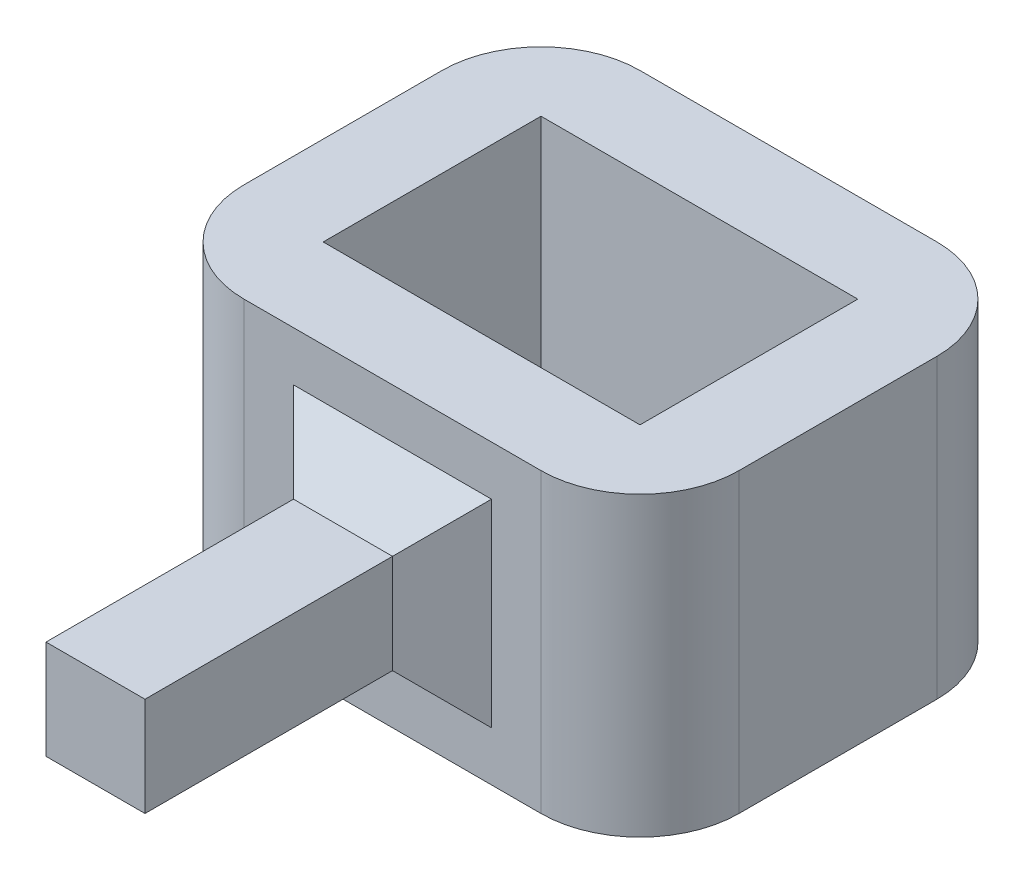
ISO-10303-21;
HEADER;
FILE_DESCRIPTION(('STEP AP214'),'2;1');
FILE_NAME('part.step','',(''),(''),'','','');
FILE_SCHEMA(('AUTOMOTIVE_DESIGN { 1 0 10303 214 1 1 1 1 }'));
ENDSEC;
DATA;
#1=APPLICATION_CONTEXT('core data for automotive mechanical design processes');
#2=APPLICATION_PROTOCOL_DEFINITION('international standard','automotive_design',2000,#1);
#3=PRODUCT_CONTEXT('',#1,'mechanical');
#4=PRODUCT('Part','Part','',(#3));
#5=PRODUCT_RELATED_PRODUCT_CATEGORY('part','',(#4));
#6=PRODUCT_DEFINITION_FORMATION('','',#4);
#7=PRODUCT_DEFINITION_CONTEXT('part definition',#1,'design');
#8=PRODUCT_DEFINITION('design','',#6,#7);
#9=PRODUCT_DEFINITION_SHAPE('','',#8);
#10=(LENGTH_UNIT() NAMED_UNIT(*) SI_UNIT(.MILLI.,.METRE.));
#11=(NAMED_UNIT(*) PLANE_ANGLE_UNIT() SI_UNIT($,.RADIAN.));
#12=(NAMED_UNIT(*) SI_UNIT($,.STERADIAN.) SOLID_ANGLE_UNIT());
#13=UNCERTAINTY_MEASURE_WITH_UNIT(LENGTH_MEASURE(1.E-05),#10,'distance_accuracy_value','');
#14=(GEOMETRIC_REPRESENTATION_CONTEXT(3) GLOBAL_UNCERTAINTY_ASSIGNED_CONTEXT((#13)) GLOBAL_UNIT_ASSIGNED_CONTEXT((#10,
#11,#12)) REPRESENTATION_CONTEXT('',''));
#15=CARTESIAN_POINT('',(0.,0.,0.));
#16=DIRECTION('',(0.,0.,1.));
#17=DIRECTION('',(1.,0.,0.));
#18=AXIS2_PLACEMENT_3D('',#15,#16,#17);
#19=CARTESIAN_POINT('',(26.8704783995024,30.,27.8608923884514));
#20=DIRECTION('',(0.,0.,-1.));
#21=DIRECTION('',(-1.,0.,0.));
#22=AXIS2_PLACEMENT_3D('',#19,#20,#21);
#23=PLANE('',#22);
#24=DIRECTION('',(0.,1.,0.));
#25=VECTOR('',#24,1.);
#26=CARTESIAN_POINT('',(-8.12952160049759,30.,27.8608923884514));
#27=LINE('',#26,#25);
#28=CARTESIAN_POINT('',(-8.12952160049758,5.00000000000002,27.8608923884514));
#29=VERTEX_POINT('',#28);
#30=CARTESIAN_POINT('',(-8.12952160049758,25.,27.8608923884514));
#31=VERTEX_POINT('',#30);
#32=EDGE_CURVE('E253',#29,#31,#27,.T.);
#33=ORIENTED_EDGE('',*,*,#32,.T.);
#34=DIRECTION('',(1.,0.,0.));
#35=VECTOR('',#34,1.);
#36=CARTESIAN_POINT('',(26.8704783995024,25.,27.8608923884514));
#37=LINE('',#36,#35);
#38=CARTESIAN_POINT('',(11.8704783995024,25.,27.8608923884514));
#39=VERTEX_POINT('',#38);
#40=EDGE_CURVE('E255',#31,#39,#37,.T.);
#41=ORIENTED_EDGE('',*,*,#40,.T.);
#42=DIRECTION('',(0.,-1.,0.));
#43=VECTOR('',#42,1.);
#44=CARTESIAN_POINT('',(11.8704783995024,10.,27.8608923884514));
#45=LINE('',#44,#43);
#46=CARTESIAN_POINT('',(11.8704783995024,5.00000000000002,27.8608923884514));
#47=VERTEX_POINT('',#46);
#48=EDGE_CURVE('E240',#39,#47,#45,.T.);
#49=ORIENTED_EDGE('',*,*,#48,.T.);
#50=DIRECTION('',(-1.,0.,0.));
#51=VECTOR('',#50,1.);
#52=CARTESIAN_POINT('',(-3.12952160049761,5.00000000000002,27.8608923884514));
#53=LINE('',#52,#51);
#54=EDGE_CURVE('E251',#47,#29,#53,.T.);
#55=ORIENTED_EDGE('',*,*,#54,.T.);
#56=EDGE_LOOP('',(#33,#41,#49,#55));
#57=FACE_BOUND('',#56,.T.);
#58=DIRECTION('',(1.,0.,0.));
#59=VECTOR('',#58,1.);
#60=CARTESIAN_POINT('',(26.8704783995024,0.,27.8608923884514));
#61=LINE('',#60,#59);
#62=CARTESIAN_POINT('',(-13.1295216004976,0.,27.8608923884514));
#63=VERTEX_POINT('',#62);
#64=CARTESIAN_POINT('',(16.8704783995024,0.,27.8608923884514));
#65=VERTEX_POINT('',#64);
#66=EDGE_CURVE('E233',#63,#65,#61,.T.);
#67=ORIENTED_EDGE('',*,*,#66,.T.);
#68=DIRECTION('',(0.,-1.,0.));
#69=VECTOR('',#68,1.);
#70=CARTESIAN_POINT('',(16.8704783995024,30.,27.8608923884514));
#71=LINE('',#70,#69);
#72=CARTESIAN_POINT('',(16.8704783995024,30.,27.8608923884514));
#73=VERTEX_POINT('',#72);
#74=EDGE_CURVE('E11',#65,#73,#71,.F.);
#75=ORIENTED_EDGE('',*,*,#74,.T.);
#76=DIRECTION('',(1.,0.,0.));
#77=VECTOR('',#76,1.);
#78=CARTESIAN_POINT('',(26.8704783995024,30.,27.8608923884514));
#79=LINE('',#78,#77);
#80=CARTESIAN_POINT('',(-13.1295216004976,30.,27.8608923884514));
#81=VERTEX_POINT('',#80);
#82=EDGE_CURVE('E238',#81,#73,#79,.T.);
#83=ORIENTED_EDGE('',*,*,#82,.F.);
#84=DIRECTION('',(0.,-1.,0.));
#85=VECTOR('',#84,1.);
#86=CARTESIAN_POINT('',(-13.1295216004976,30.,27.8608923884514));
#87=LINE('',#86,#85);
#88=EDGE_CURVE('E49',#81,#63,#87,.T.);
#89=ORIENTED_EDGE('',*,*,#88,.T.);
#90=EDGE_LOOP('',(#67,#75,#83,#89));
#91=FACE_BOUND('',#90,.T.);
#92=ADVANCED_FACE('F41',(#57,#91),#23,.F.);
#93=CARTESIAN_POINT('',(0.,30.,0.));
#94=DIRECTION('',(0.,-1.,0.));
#95=DIRECTION('',(0.,0.,-1.));
#96=AXIS2_PLACEMENT_3D('',#93,#94,#95);
#97=PLANE('',#96);
#98=DIRECTION('',(-1.,0.,0.));
#99=VECTOR('',#98,1.);
#100=CARTESIAN_POINT('',(26.8704783995024,30.,-12.1391076115486));
#101=LINE('',#100,#99);
#102=CARTESIAN_POINT('',(16.8704783995024,30.,-12.1391076115486));
#103=VERTEX_POINT('',#102);
#104=CARTESIAN_POINT('',(-13.1295216004976,30.,-12.1391076115486));
#105=VERTEX_POINT('',#104);
#106=EDGE_CURVE('E232',#103,#105,#101,.T.);
#107=ORIENTED_EDGE('',*,*,#106,.T.);
#108=CARTESIAN_POINT('',(-13.1295216004976,30.,-2.13910761154857));
#109=DIRECTION('',(0.,-1.,0.));
#110=DIRECTION('',(0.,0.,-1.));
#111=AXIS2_PLACEMENT_3D('',#108,#109,#110);
#112=CIRCLE('',#111,10.);
#113=CARTESIAN_POINT('',(-23.1295216004976,30.,-2.13910761154856));
#114=VERTEX_POINT('',#113);
#115=EDGE_CURVE('E298',#105,#114,#112,.F.);
#116=ORIENTED_EDGE('',*,*,#115,.T.);
#117=DIRECTION('',(0.,0.,1.));
#118=VECTOR('',#117,1.);
#119=CARTESIAN_POINT('',(-23.1295216004976,30.,-12.1391076115486));
#120=LINE('',#119,#118);
#121=CARTESIAN_POINT('',(-23.1295216004976,30.,17.8608923884514));
#122=VERTEX_POINT('',#121);
#123=EDGE_CURVE('E236',#114,#122,#120,.T.);
#124=ORIENTED_EDGE('',*,*,#123,.T.);
#125=CARTESIAN_POINT('',(-13.1295216004976,30.,17.8608923884514));
#126=DIRECTION('',(0.,-1.,0.));
#127=DIRECTION('',(0.,0.,-1.));
#128=AXIS2_PLACEMENT_3D('',#125,#126,#127);
#129=CIRCLE('',#128,10.);
#130=EDGE_CURVE('E61',#122,#81,#129,.F.);
#131=ORIENTED_EDGE('',*,*,#130,.T.);
#132=ORIENTED_EDGE('',*,*,#82,.T.);
#133=CARTESIAN_POINT('',(16.8704783995024,30.,17.8608923884514));
#134=DIRECTION('',(0.,-1.,0.));
#135=DIRECTION('',(0.,0.,-1.));
#136=AXIS2_PLACEMENT_3D('',#133,#134,#135);
#137=CIRCLE('',#136,10.);
#138=CARTESIAN_POINT('',(26.8704783995024,30.,17.8608923884514));
#139=VERTEX_POINT('',#138);
#140=EDGE_CURVE('E294',#73,#139,#137,.F.);
#141=ORIENTED_EDGE('',*,*,#140,.T.);
#142=DIRECTION('',(0.,0.,-1.));
#143=VECTOR('',#142,1.);
#144=CARTESIAN_POINT('',(26.8704783995024,30.,-12.1391076115486));
#145=LINE('',#144,#143);
#146=CARTESIAN_POINT('',(26.8704783995024,30.,-2.13910761154857));
#147=VERTEX_POINT('',#146);
#148=EDGE_CURVE('E229',#139,#147,#145,.T.);
#149=ORIENTED_EDGE('',*,*,#148,.T.);
#150=CARTESIAN_POINT('',(16.8704783995024,30.,-2.13910761154857));
#151=DIRECTION('',(0.,-1.,0.));
#152=DIRECTION('',(0.,0.,-1.));
#153=AXIS2_PLACEMENT_3D('',#150,#151,#152);
#154=CIRCLE('',#153,10.);
#155=EDGE_CURVE('E296',#147,#103,#154,.F.);
#156=ORIENTED_EDGE('',*,*,#155,.T.);
#157=EDGE_LOOP('',(#107,#116,#124,#131,#132,#141,#149,#156));
#158=FACE_BOUND('',#157,.T.);
#159=DIRECTION('',(-1.,0.,0.));
#160=VECTOR('',#159,1.);
#161=CARTESIAN_POINT('',(17.8704783995024,30.,-3.13910761154857));
#162=LINE('',#161,#160);
#163=CARTESIAN_POINT('',(17.8704783995024,30.,-3.13910761154857));
#164=VERTEX_POINT('',#163);
#165=CARTESIAN_POINT('',(-14.1295216004976,30.,-3.13910761154856));
#166=VERTEX_POINT('',#165);
#167=EDGE_CURVE('E201',#164,#166,#162,.T.);
#168=ORIENTED_EDGE('',*,*,#167,.F.);
#169=DIRECTION('',(0.,0.,-1.));
#170=VECTOR('',#169,1.);
#171=CARTESIAN_POINT('',(17.8704783995024,30.,-3.13910761154857));
#172=LINE('',#171,#170);
#173=CARTESIAN_POINT('',(17.8704783995024,30.,18.8608923884514));
#174=VERTEX_POINT('',#173);
#175=EDGE_CURVE('E209',#174,#164,#172,.T.);
#176=ORIENTED_EDGE('',*,*,#175,.F.);
#177=DIRECTION('',(1.,0.,0.));
#178=VECTOR('',#177,1.);
#179=CARTESIAN_POINT('',(17.8704783995024,30.,18.8608923884514));
#180=LINE('',#179,#178);
#181=CARTESIAN_POINT('',(-14.1295216004976,30.,18.8608923884514));
#182=VERTEX_POINT('',#181);
#183=EDGE_CURVE('E206',#182,#174,#180,.T.);
#184=ORIENTED_EDGE('',*,*,#183,.F.);
#185=DIRECTION('',(0.,0.,1.));
#186=VECTOR('',#185,1.);
#187=CARTESIAN_POINT('',(-14.1295216004976,30.,-3.13910761154856));
#188=LINE('',#187,#186);
#189=EDGE_CURVE('E203',#166,#182,#188,.T.);
#190=ORIENTED_EDGE('',*,*,#189,.F.);
#191=EDGE_LOOP('',(#168,#176,#184,#190));
#192=FACE_BOUND('',#191,.T.);
#193=ADVANCED_FACE('F322',(#158,#192),#97,.F.);
#194=CARTESIAN_POINT('',(0.,0.,0.));
#195=DIRECTION('',(0.,-1.,0.));
#196=DIRECTION('',(0.,0.,-1.));
#197=AXIS2_PLACEMENT_3D('',#194,#195,#196);
#198=PLANE('',#197);
#199=DIRECTION('',(0.,0.,1.));
#200=VECTOR('',#199,1.);
#201=CARTESIAN_POINT('',(-23.1295216004976,0.,-12.1391076115486));
#202=LINE('',#201,#200);
#203=CARTESIAN_POINT('',(-23.1295216004976,0.,-2.13910761154856));
#204=VERTEX_POINT('',#203);
#205=CARTESIAN_POINT('',(-23.1295216004976,0.,17.8608923884514));
#206=VERTEX_POINT('',#205);
#207=EDGE_CURVE('E246',#204,#206,#202,.T.);
#208=ORIENTED_EDGE('',*,*,#207,.F.);
#209=CARTESIAN_POINT('',(-13.1295216004976,0.,-2.13910761154857));
#210=DIRECTION('',(0.,-1.,0.));
#211=DIRECTION('',(0.,0.,-1.));
#212=AXIS2_PLACEMENT_3D('',#209,#210,#211);
#213=CIRCLE('',#212,10.);
#214=CARTESIAN_POINT('',(-13.1295216004976,0.,-12.1391076115486));
#215=VERTEX_POINT('',#214);
#216=EDGE_CURVE('E286',#204,#215,#213,.T.);
#217=ORIENTED_EDGE('',*,*,#216,.T.);
#218=DIRECTION('',(-1.,0.,0.));
#219=VECTOR('',#218,1.);
#220=CARTESIAN_POINT('',(26.8704783995024,0.,-12.1391076115486));
#221=LINE('',#220,#219);
#222=CARTESIAN_POINT('',(16.8704783995024,0.,-12.1391076115486));
#223=VERTEX_POINT('',#222);
#224=EDGE_CURVE('E243',#223,#215,#221,.T.);
#225=ORIENTED_EDGE('',*,*,#224,.F.);
#226=CARTESIAN_POINT('',(16.8704783995024,0.,-2.13910761154857));
#227=DIRECTION('',(0.,-1.,0.));
#228=DIRECTION('',(0.,0.,-1.));
#229=AXIS2_PLACEMENT_3D('',#226,#227,#228);
#230=CIRCLE('',#229,10.);
#231=CARTESIAN_POINT('',(26.8704783995024,0.,-2.13910761154857));
#232=VERTEX_POINT('',#231);
#233=EDGE_CURVE('E284',#223,#232,#230,.T.);
#234=ORIENTED_EDGE('',*,*,#233,.T.);
#235=DIRECTION('',(0.,0.,-1.));
#236=VECTOR('',#235,1.);
#237=CARTESIAN_POINT('',(26.8704783995024,0.,-12.1391076115486));
#238=LINE('',#237,#236);
#239=CARTESIAN_POINT('',(26.8704783995024,0.,17.8608923884514));
#240=VERTEX_POINT('',#239);
#241=EDGE_CURVE('E228',#240,#232,#238,.T.);
#242=ORIENTED_EDGE('',*,*,#241,.F.);
#243=CARTESIAN_POINT('',(16.8704783995024,0.,17.8608923884514));
#244=DIRECTION('',(0.,-1.,0.));
#245=DIRECTION('',(0.,0.,-1.));
#246=AXIS2_PLACEMENT_3D('',#243,#244,#245);
#247=CIRCLE('',#246,10.);
#248=EDGE_CURVE('E282',#240,#65,#247,.T.);
#249=ORIENTED_EDGE('',*,*,#248,.T.);
#250=ORIENTED_EDGE('',*,*,#66,.F.);
#251=CARTESIAN_POINT('',(-13.1295216004976,0.,17.8608923884514));
#252=DIRECTION('',(0.,-1.,0.));
#253=DIRECTION('',(0.,0.,-1.));
#254=AXIS2_PLACEMENT_3D('',#251,#252,#253);
#255=CIRCLE('',#254,10.);
#256=EDGE_CURVE('E280',#63,#206,#255,.T.);
#257=ORIENTED_EDGE('',*,*,#256,.T.);
#258=EDGE_LOOP('',(#208,#217,#225,#234,#242,#249,#250,#257));
#259=FACE_BOUND('',#258,.T.);
#260=DIRECTION('',(0.,0.,-1.));
#261=VECTOR('',#260,1.);
#262=CARTESIAN_POINT('',(17.8704783995024,0.,-3.13910761154857));
#263=LINE('',#262,#261);
#264=CARTESIAN_POINT('',(17.8704783995024,0.,18.8608923884514));
#265=VERTEX_POINT('',#264);
#266=CARTESIAN_POINT('',(17.8704783995024,0.,-3.13910761154857));
#267=VERTEX_POINT('',#266);
#268=EDGE_CURVE('E204',#265,#267,#263,.T.);
#269=ORIENTED_EDGE('',*,*,#268,.T.);
#270=DIRECTION('',(-1.,0.,0.));
#271=VECTOR('',#270,1.);
#272=CARTESIAN_POINT('',(17.8704783995024,0.,-3.13910761154857));
#273=LINE('',#272,#271);
#274=CARTESIAN_POINT('',(-14.1295216004976,0.,-3.13910761154856));
#275=VERTEX_POINT('',#274);
#276=EDGE_CURVE('E192',#267,#275,#273,.T.);
#277=ORIENTED_EDGE('',*,*,#276,.T.);
#278=DIRECTION('',(0.,0.,1.));
#279=VECTOR('',#278,1.);
#280=CARTESIAN_POINT('',(-14.1295216004976,0.,-3.13910761154856));
#281=LINE('',#280,#279);
#282=CARTESIAN_POINT('',(-14.1295216004976,0.,18.8608923884514));
#283=VERTEX_POINT('',#282);
#284=EDGE_CURVE('E195',#275,#283,#281,.T.);
#285=ORIENTED_EDGE('',*,*,#284,.T.);
#286=DIRECTION('',(1.,0.,0.));
#287=VECTOR('',#286,1.);
#288=CARTESIAN_POINT('',(17.8704783995024,0.,18.8608923884514));
#289=LINE('',#288,#287);
#290=EDGE_CURVE('E214',#283,#265,#289,.T.);
#291=ORIENTED_EDGE('',*,*,#290,.T.);
#292=EDGE_LOOP('',(#269,#277,#285,#291));
#293=FACE_BOUND('',#292,.T.);
#294=ADVANCED_FACE('F310',(#259,#293),#198,.T.);
#295=CARTESIAN_POINT('',(26.8704783995024,30.,-12.1391076115486));
#296=DIRECTION('',(-1.,0.,0.));
#297=DIRECTION('',(0.,0.,1.));
#298=AXIS2_PLACEMENT_3D('',#295,#296,#297);
#299=PLANE('',#298);
#300=ORIENTED_EDGE('',*,*,#241,.T.);
#301=DIRECTION('',(0.,-1.,0.));
#302=VECTOR('',#301,1.);
#303=CARTESIAN_POINT('',(26.8704783995024,30.,-2.13910761154857));
#304=LINE('',#303,#302);
#305=EDGE_CURVE('E303',#232,#147,#304,.F.);
#306=ORIENTED_EDGE('',*,*,#305,.T.);
#307=ORIENTED_EDGE('',*,*,#148,.F.);
#308=DIRECTION('',(0.,-1.,0.));
#309=VECTOR('',#308,1.);
#310=CARTESIAN_POINT('',(26.8704783995024,30.,17.8608923884514));
#311=LINE('',#310,#309);
#312=EDGE_CURVE('E300',#139,#240,#311,.T.);
#313=ORIENTED_EDGE('',*,*,#312,.T.);
#314=EDGE_LOOP('',(#300,#306,#307,#313));
#315=FACE_BOUND('',#314,.T.);
#316=ADVANCED_FACE('F319',(#315),#299,.F.);
#317=CARTESIAN_POINT('',(26.8704783995024,30.,-12.1391076115486));
#318=DIRECTION('',(0.,0.,1.));
#319=DIRECTION('',(1.,0.,0.));
#320=AXIS2_PLACEMENT_3D('',#317,#318,#319);
#321=PLANE('',#320);
#322=ORIENTED_EDGE('',*,*,#224,.T.);
#323=DIRECTION('',(0.,-1.,0.));
#324=VECTOR('',#323,1.);
#325=CARTESIAN_POINT('',(-13.1295216004976,30.,-12.1391076115486));
#326=LINE('',#325,#324);
#327=EDGE_CURVE('E291',#215,#105,#326,.F.);
#328=ORIENTED_EDGE('',*,*,#327,.T.);
#329=ORIENTED_EDGE('',*,*,#106,.F.);
#330=DIRECTION('',(0.,-1.,0.));
#331=VECTOR('',#330,1.);
#332=CARTESIAN_POINT('',(16.8704783995024,30.,-12.1391076115486));
#333=LINE('',#332,#331);
#334=EDGE_CURVE('E288',#103,#223,#333,.T.);
#335=ORIENTED_EDGE('',*,*,#334,.T.);
#336=EDGE_LOOP('',(#322,#328,#329,#335));
#337=FACE_BOUND('',#336,.T.);
#338=ADVANCED_FACE('F330',(#337),#321,.F.);
#339=CARTESIAN_POINT('',(-23.1295216004976,30.,-12.1391076115486));
#340=DIRECTION('',(1.,0.,0.));
#341=DIRECTION('',(0.,0.,-1.));
#342=AXIS2_PLACEMENT_3D('',#339,#340,#341);
#343=PLANE('',#342);
#344=ORIENTED_EDGE('',*,*,#123,.F.);
#345=DIRECTION('',(0.,-1.,0.));
#346=VECTOR('',#345,1.);
#347=CARTESIAN_POINT('',(-23.1295216004976,30.,-2.13910761154856));
#348=LINE('',#347,#346);
#349=EDGE_CURVE('E277',#114,#204,#348,.T.);
#350=ORIENTED_EDGE('',*,*,#349,.T.);
#351=ORIENTED_EDGE('',*,*,#207,.T.);
#352=DIRECTION('',(0.,-1.,0.));
#353=VECTOR('',#352,1.);
#354=CARTESIAN_POINT('',(-23.1295216004976,30.,17.8608923884514));
#355=LINE('',#354,#353);
#356=EDGE_CURVE('E266',#206,#122,#355,.F.);
#357=ORIENTED_EDGE('',*,*,#356,.T.);
#358=EDGE_LOOP('',(#344,#350,#351,#357));
#359=FACE_BOUND('',#358,.T.);
#360=ADVANCED_FACE('F338',(#359),#343,.F.);
#361=CARTESIAN_POINT('',(17.8704783995024,30.,-3.13910761154857));
#362=DIRECTION('',(0.,0.,1.));
#363=DIRECTION('',(1.,0.,0.));
#364=AXIS2_PLACEMENT_3D('',#361,#362,#363);
#365=PLANE('',#364);
#366=ORIENTED_EDGE('',*,*,#276,.F.);
#367=DIRECTION('',(0.,-1.,0.));
#368=VECTOR('',#367,1.);
#369=CARTESIAN_POINT('',(17.8704783995024,30.,-3.13910761154857));
#370=LINE('',#369,#368);
#371=EDGE_CURVE('E210',#164,#267,#370,.T.);
#372=ORIENTED_EDGE('',*,*,#371,.F.);
#373=ORIENTED_EDGE('',*,*,#167,.T.);
#374=DIRECTION('',(0.,-1.,0.));
#375=VECTOR('',#374,1.);
#376=CARTESIAN_POINT('',(-14.1295216004976,30.,-3.13910761154856));
#377=LINE('',#376,#375);
#378=EDGE_CURVE('E225',#166,#275,#377,.T.);
#379=ORIENTED_EDGE('',*,*,#378,.T.);
#380=EDGE_LOOP('',(#366,#372,#373,#379));
#381=FACE_BOUND('',#380,.T.);
#382=ADVANCED_FACE('F355',(#381),#365,.T.);
#383=CARTESIAN_POINT('',(-14.1295216004976,30.,-3.13910761154856));
#384=DIRECTION('',(1.,0.,0.));
#385=DIRECTION('',(0.,0.,-1.));
#386=AXIS2_PLACEMENT_3D('',#383,#384,#385);
#387=PLANE('',#386);
#388=ORIENTED_EDGE('',*,*,#284,.F.);
#389=ORIENTED_EDGE('',*,*,#378,.F.);
#390=ORIENTED_EDGE('',*,*,#189,.T.);
#391=DIRECTION('',(0.,-1.,0.));
#392=VECTOR('',#391,1.);
#393=CARTESIAN_POINT('',(-14.1295216004976,30.,18.8608923884514));
#394=LINE('',#393,#392);
#395=EDGE_CURVE('E223',#182,#283,#394,.T.);
#396=ORIENTED_EDGE('',*,*,#395,.T.);
#397=EDGE_LOOP('',(#388,#389,#390,#396));
#398=FACE_BOUND('',#397,.T.);
#399=ADVANCED_FACE('F511',(#398),#387,.T.);
#400=CARTESIAN_POINT('',(17.8704783995024,30.,18.8608923884514));
#401=DIRECTION('',(0.,0.,-1.));
#402=DIRECTION('',(-1.,0.,0.));
#403=AXIS2_PLACEMENT_3D('',#400,#401,#402);
#404=PLANE('',#403);
#405=ORIENTED_EDGE('',*,*,#290,.F.);
#406=ORIENTED_EDGE('',*,*,#395,.F.);
#407=ORIENTED_EDGE('',*,*,#183,.T.);
#408=DIRECTION('',(0.,-1.,0.));
#409=VECTOR('',#408,1.);
#410=CARTESIAN_POINT('',(17.8704783995024,30.,18.8608923884514));
#411=LINE('',#410,#409);
#412=EDGE_CURVE('E221',#174,#265,#411,.T.);
#413=ORIENTED_EDGE('',*,*,#412,.T.);
#414=EDGE_LOOP('',(#405,#406,#407,#413));
#415=FACE_BOUND('',#414,.T.);
#416=ADVANCED_FACE('F501',(#415),#404,.T.);
#417=CARTESIAN_POINT('',(17.8704783995024,30.,-3.13910761154857));
#418=DIRECTION('',(-1.,0.,0.));
#419=DIRECTION('',(0.,0.,1.));
#420=AXIS2_PLACEMENT_3D('',#417,#418,#419);
#421=PLANE('',#420);
#422=ORIENTED_EDGE('',*,*,#268,.F.);
#423=ORIENTED_EDGE('',*,*,#412,.F.);
#424=ORIENTED_EDGE('',*,*,#175,.T.);
#425=ORIENTED_EDGE('',*,*,#371,.T.);
#426=EDGE_LOOP('',(#422,#423,#424,#425));
#427=FACE_BOUND('',#426,.T.);
#428=ADVANCED_FACE('F485',(#427),#421,.T.);
#429=CARTESIAN_POINT('',(0.,10.,57.8608923884514));
#430=DIRECTION('',(0.,1.,0.));
#431=DIRECTION('',(0.,0.,1.));
#432=AXIS2_PLACEMENT_3D('',#429,#430,#431);
#433=PLANE('',#432);
#434=DIRECTION('',(0.,0.,-1.));
#435=VECTOR('',#434,1.);
#436=CARTESIAN_POINT('',(-3.12952160049761,10.,57.8608923884514));
#437=LINE('',#436,#435);
#438=CARTESIAN_POINT('',(-3.12952160049761,10.,57.8608923884514));
#439=VERTEX_POINT('',#438);
#440=CARTESIAN_POINT('',(-3.12952160049761,10.,32.8608923884515));
#441=VERTEX_POINT('',#440);
#442=EDGE_CURVE('E621',#439,#441,#437,.T.);
#443=ORIENTED_EDGE('',*,*,#442,.T.);
#444=DIRECTION('',(1.,0.,0.));
#445=VECTOR('',#444,1.);
#446=CARTESIAN_POINT('',(6.87047839950239,10.,32.8608923884515));
#447=LINE('',#446,#445);
#448=CARTESIAN_POINT('',(6.87047839950239,10.,32.8608923884515));
#449=VERTEX_POINT('',#448);
#450=EDGE_CURVE('E191',#441,#449,#447,.T.);
#451=ORIENTED_EDGE('',*,*,#450,.T.);
#452=DIRECTION('',(0.,0.,-1.));
#453=VECTOR('',#452,1.);
#454=CARTESIAN_POINT('',(6.87047839950239,10.,57.8608923884514));
#455=LINE('',#454,#453);
#456=CARTESIAN_POINT('',(6.87047839950239,10.,57.8608923884514));
#457=VERTEX_POINT('',#456);
#458=EDGE_CURVE('E170',#457,#449,#455,.T.);
#459=ORIENTED_EDGE('',*,*,#458,.F.);
#460=DIRECTION('',(1.,0.,0.));
#461=VECTOR('',#460,1.);
#462=CARTESIAN_POINT('',(0.,10.,57.8608923884514));
#463=LINE('',#462,#461);
#464=EDGE_CURVE('E178',#439,#457,#463,.T.);
#465=ORIENTED_EDGE('',*,*,#464,.F.);
#466=EDGE_LOOP('',(#443,#451,#459,#465));
#467=FACE_BOUND('',#466,.T.);
#468=ADVANCED_FACE('F189',(#467),#433,.F.);
#469=CARTESIAN_POINT('',(6.87047839950239,0.,57.8608923884514));
#470=DIRECTION('',(-1.,0.,0.));
#471=DIRECTION('',(0.,0.,1.));
#472=AXIS2_PLACEMENT_3D('',#469,#470,#471);
#473=PLANE('',#472);
#474=ORIENTED_EDGE('',*,*,#458,.T.);
#475=DIRECTION('',(0.,1.,0.));
#476=VECTOR('',#475,1.);
#477=CARTESIAN_POINT('',(6.87047839950239,20.,32.8608923884515));
#478=LINE('',#477,#476);
#479=CARTESIAN_POINT('',(6.87047839950239,20.,32.8608923884515));
#480=VERTEX_POINT('',#479);
#481=EDGE_CURVE('E264',#449,#480,#478,.T.);
#482=ORIENTED_EDGE('',*,*,#481,.T.);
#483=DIRECTION('',(0.,0.,-1.));
#484=VECTOR('',#483,1.);
#485=CARTESIAN_POINT('',(6.87047839950239,20.,57.8608923884514));
#486=LINE('',#485,#484);
#487=CARTESIAN_POINT('',(6.87047839950239,20.,57.8608923884514));
#488=VERTEX_POINT('',#487);
#489=EDGE_CURVE('E173',#488,#480,#486,.T.);
#490=ORIENTED_EDGE('',*,*,#489,.F.);
#491=DIRECTION('',(0.,1.,0.));
#492=VECTOR('',#491,1.);
#493=CARTESIAN_POINT('',(6.87047839950239,0.,57.8608923884514));
#494=LINE('',#493,#492);
#495=EDGE_CURVE('E166',#457,#488,#494,.T.);
#496=ORIENTED_EDGE('',*,*,#495,.F.);
#497=EDGE_LOOP('',(#474,#482,#490,#496));
#498=FACE_BOUND('',#497,.T.);
#499=ADVANCED_FACE('F168',(#498),#473,.F.);
#500=CARTESIAN_POINT('',(0.,20.,57.8608923884514));
#501=DIRECTION('',(0.,1.,0.));
#502=DIRECTION('',(0.,0.,1.));
#503=AXIS2_PLACEMENT_3D('',#500,#501,#502);
#504=PLANE('',#503);
#505=ORIENTED_EDGE('',*,*,#489,.T.);
#506=DIRECTION('',(-1.,0.,0.));
#507=VECTOR('',#506,1.);
#508=CARTESIAN_POINT('',(0.,20.,32.8608923884515));
#509=LINE('',#508,#507);
#510=CARTESIAN_POINT('',(-3.12952160049761,20.,32.8608923884515));
#511=VERTEX_POINT('',#510);
#512=EDGE_CURVE('E258',#480,#511,#509,.T.);
#513=ORIENTED_EDGE('',*,*,#512,.T.);
#514=DIRECTION('',(0.,0.,-1.));
#515=VECTOR('',#514,1.);
#516=CARTESIAN_POINT('',(-3.12952160049761,20.,57.8608923884514));
#517=LINE('',#516,#515);
#518=CARTESIAN_POINT('',(-3.12952160049761,20.,57.8608923884514));
#519=VERTEX_POINT('',#518);
#520=EDGE_CURVE('E197',#519,#511,#517,.T.);
#521=ORIENTED_EDGE('',*,*,#520,.F.);
#522=DIRECTION('',(1.,0.,0.));
#523=VECTOR('',#522,1.);
#524=CARTESIAN_POINT('',(0.,20.,57.8608923884514));
#525=LINE('',#524,#523);
#526=EDGE_CURVE('E177',#519,#488,#525,.T.);
#527=ORIENTED_EDGE('',*,*,#526,.T.);
#528=EDGE_LOOP('',(#505,#513,#521,#527));
#529=FACE_BOUND('',#528,.T.);
#530=ADVANCED_FACE('F458',(#529),#504,.T.);
#531=CARTESIAN_POINT('',(-3.12952160049761,0.,57.8608923884514));
#532=DIRECTION('',(-1.,0.,0.));
#533=DIRECTION('',(0.,0.,1.));
#534=AXIS2_PLACEMENT_3D('',#531,#532,#533);
#535=PLANE('',#534);
#536=ORIENTED_EDGE('',*,*,#520,.T.);
#537=DIRECTION('',(0.,-1.,0.));
#538=VECTOR('',#537,1.);
#539=CARTESIAN_POINT('',(-3.12952160049761,0.,32.8608923884515));
#540=LINE('',#539,#538);
#541=EDGE_CURVE('E261',#511,#441,#540,.T.);
#542=ORIENTED_EDGE('',*,*,#541,.T.);
#543=ORIENTED_EDGE('',*,*,#442,.F.);
#544=DIRECTION('',(0.,1.,0.));
#545=VECTOR('',#544,1.);
#546=CARTESIAN_POINT('',(-3.12952160049761,0.,57.8608923884514));
#547=LINE('',#546,#545);
#548=EDGE_CURVE('E184',#439,#519,#547,.T.);
#549=ORIENTED_EDGE('',*,*,#548,.T.);
#550=EDGE_LOOP('',(#536,#542,#543,#549));
#551=FACE_BOUND('',#550,.T.);
#552=ADVANCED_FACE('F449',(#551),#535,.T.);
#553=CARTESIAN_POINT('',(0.,0.,57.8608923884514));
#554=DIRECTION('',(0.,0.,1.));
#555=DIRECTION('',(1.,0.,0.));
#556=AXIS2_PLACEMENT_3D('',#553,#554,#555);
#557=PLANE('',#556);
#558=ORIENTED_EDGE('',*,*,#464,.T.);
#559=ORIENTED_EDGE('',*,*,#495,.T.);
#560=ORIENTED_EDGE('',*,*,#526,.F.);
#561=ORIENTED_EDGE('',*,*,#548,.F.);
#562=EDGE_LOOP('',(#558,#559,#560,#561));
#563=FACE_BOUND('',#562,.T.);
#564=ADVANCED_FACE('F182',(#563),#557,.T.);
#565=CARTESIAN_POINT('',(0.,10.,32.8608923884515));
#566=DIRECTION('',(0.,-0.70710678118655,0.707106781186545));
#567=DIRECTION('',(-1.,0.,0.));
#568=AXIS2_PLACEMENT_3D('',#565,#566,#567);
#569=PLANE('',#568);
#570=DIRECTION('',(0.577350269189624,-0.577350269189624,-0.577350269189629));
#571=VECTOR('',#570,1.);
#572=CARTESIAN_POINT('',(10.2038117328357,6.66666666666669,29.5275590551181));
#573=LINE('',#572,#571);
#574=EDGE_CURVE('E271',#449,#47,#573,.T.);
#575=ORIENTED_EDGE('',*,*,#574,.F.);
#576=ORIENTED_EDGE('',*,*,#450,.F.);
#577=DIRECTION('',(0.577350269189624,0.577350269189625,0.577350269189629));
#578=VECTOR('',#577,1.);
#579=CARTESIAN_POINT('',(-2.08634773366508,11.0431738668325,33.904066255284));
#580=LINE('',#579,#578);
#581=EDGE_CURVE('E187',#29,#441,#580,.T.);
#582=ORIENTED_EDGE('',*,*,#581,.F.);
#583=ORIENTED_EDGE('',*,*,#54,.F.);
#584=EDGE_LOOP('',(#575,#576,#582,#583));
#585=FACE_BOUND('',#584,.T.);
#586=ADVANCED_FACE('F381',(#585),#569,.T.);
#587=CARTESIAN_POINT('',(-8.12952160049759,30.,27.8608923884514));
#588=DIRECTION('',(0.70710678118655,0.,-0.707106781186545));
#589=DIRECTION('',(0.,1.,0.));
#590=AXIS2_PLACEMENT_3D('',#587,#588,#589);
#591=PLANE('',#590);
#592=ORIENTED_EDGE('',*,*,#581,.T.);
#593=ORIENTED_EDGE('',*,*,#541,.F.);
#594=DIRECTION('',(-0.577350269189624,0.577350269189624,-0.577350269189629));
#595=VECTOR('',#594,1.);
#596=CARTESIAN_POINT('',(-9.79618826716425,26.6666666666666,26.1942257217848));
#597=LINE('',#596,#595);
#598=EDGE_CURVE('E269',#31,#511,#597,.F.);
#599=ORIENTED_EDGE('',*,*,#598,.F.);
#600=ORIENTED_EDGE('',*,*,#32,.F.);
#601=EDGE_LOOP('',(#592,#593,#599,#600));
#602=FACE_BOUND('',#601,.T.);
#603=ADVANCED_FACE('F374',(#602),#591,.F.);
#604=CARTESIAN_POINT('',(6.87047839950239,0.,32.8608923884515));
#605=DIRECTION('',(0.70710678118655,0.,0.707106781186545));
#606=DIRECTION('',(0.,-1.,0.));
#607=AXIS2_PLACEMENT_3D('',#604,#605,#606);
#608=PLANE('',#607);
#609=ORIENTED_EDGE('',*,*,#574,.T.);
#610=ORIENTED_EDGE('',*,*,#48,.F.);
#611=DIRECTION('',(0.577350269189624,0.577350269189624,-0.577350269189629));
#612=VECTOR('',#611,1.);
#613=CARTESIAN_POINT('',(0.203811732835756,13.3333333333334,39.5275590551181));
#614=LINE('',#613,#612);
#615=EDGE_CURVE('E267',#480,#39,#614,.T.);
#616=ORIENTED_EDGE('',*,*,#615,.F.);
#617=ORIENTED_EDGE('',*,*,#481,.F.);
#618=EDGE_LOOP('',(#609,#610,#616,#617));
#619=FACE_BOUND('',#618,.T.);
#620=ADVANCED_FACE('F367',(#619),#608,.T.);
#621=CARTESIAN_POINT('',(26.8704783995024,25.,27.8608923884514));
#622=DIRECTION('',(0.,-0.70710678118655,-0.707106781186545));
#623=DIRECTION('',(1.,0.,0.));
#624=AXIS2_PLACEMENT_3D('',#621,#622,#623);
#625=PLANE('',#624);
#626=ORIENTED_EDGE('',*,*,#598,.T.);
#627=ORIENTED_EDGE('',*,*,#512,.F.);
#628=ORIENTED_EDGE('',*,*,#615,.T.);
#629=ORIENTED_EDGE('',*,*,#40,.F.);
#630=EDGE_LOOP('',(#626,#627,#628,#629));
#631=FACE_BOUND('',#630,.T.);
#632=ADVANCED_FACE('F361',(#631),#625,.F.);
#633=CARTESIAN_POINT('',(-13.1295216004976,30.,-2.13910761154857));
#634=DIRECTION('',(0.,-1.,0.));
#635=DIRECTION('',(0.,0.,-1.));
#636=AXIS2_PLACEMENT_3D('',#633,#634,#635);
#637=CYLINDRICAL_SURFACE('',#636,10.);
#638=ORIENTED_EDGE('',*,*,#115,.F.);
#639=ORIENTED_EDGE('',*,*,#327,.F.);
#640=ORIENTED_EDGE('',*,*,#216,.F.);
#641=ORIENTED_EDGE('',*,*,#349,.F.);
#642=EDGE_LOOP('',(#638,#639,#640,#641));
#643=FACE_BOUND('',#642,.T.);
#644=ADVANCED_FACE('F335',(#643),#637,.T.);
#645=CARTESIAN_POINT('',(16.8704783995024,30.,-2.13910761154857));
#646=DIRECTION('',(0.,-1.,0.));
#647=DIRECTION('',(0.,0.,-1.));
#648=AXIS2_PLACEMENT_3D('',#645,#646,#647);
#649=CYLINDRICAL_SURFACE('',#648,10.);
#650=ORIENTED_EDGE('',*,*,#155,.F.);
#651=ORIENTED_EDGE('',*,*,#305,.F.);
#652=ORIENTED_EDGE('',*,*,#233,.F.);
#653=ORIENTED_EDGE('',*,*,#334,.F.);
#654=EDGE_LOOP('',(#650,#651,#652,#653));
#655=FACE_BOUND('',#654,.T.);
#656=ADVANCED_FACE('F327',(#655),#649,.T.);
#657=CARTESIAN_POINT('',(16.8704783995024,30.,17.8608923884514));
#658=DIRECTION('',(0.,-1.,0.));
#659=DIRECTION('',(0.,0.,-1.));
#660=AXIS2_PLACEMENT_3D('',#657,#658,#659);
#661=CYLINDRICAL_SURFACE('',#660,10.);
#662=ORIENTED_EDGE('',*,*,#140,.F.);
#663=ORIENTED_EDGE('',*,*,#74,.F.);
#664=ORIENTED_EDGE('',*,*,#248,.F.);
#665=ORIENTED_EDGE('',*,*,#312,.F.);
#666=EDGE_LOOP('',(#662,#663,#664,#665));
#667=FACE_BOUND('',#666,.T.);
#668=ADVANCED_FACE('F316',(#667),#661,.T.);
#669=CARTESIAN_POINT('',(-13.1295216004976,30.,17.8608923884514));
#670=DIRECTION('',(0.,-1.,0.));
#671=DIRECTION('',(0.,0.,-1.));
#672=AXIS2_PLACEMENT_3D('',#669,#670,#671);
#673=CYLINDRICAL_SURFACE('',#672,10.);
#674=ORIENTED_EDGE('',*,*,#130,.F.);
#675=ORIENTED_EDGE('',*,*,#356,.F.);
#676=ORIENTED_EDGE('',*,*,#256,.F.);
#677=ORIENTED_EDGE('',*,*,#88,.F.);
#678=EDGE_LOOP('',(#674,#675,#676,#677));
#679=FACE_BOUND('',#678,.T.);
#680=ADVANCED_FACE('F43',(#679),#673,.T.);
#681=CLOSED_SHELL('',(#92,#193,#294,#316,#338,#360,#382,#399,#416,#428,#468,#499,#530,#552,#564,
#586,#603,#620,#632,#644,#656,#668,#680));
#682=MANIFOLD_SOLID_BREP('B2',#681);
#683=ADVANCED_BREP_SHAPE_REPRESENTATION('',(#18,#682),#14);
#684=SHAPE_DEFINITION_REPRESENTATION(#9,#683);
ENDSEC;
END-ISO-10303-21;
